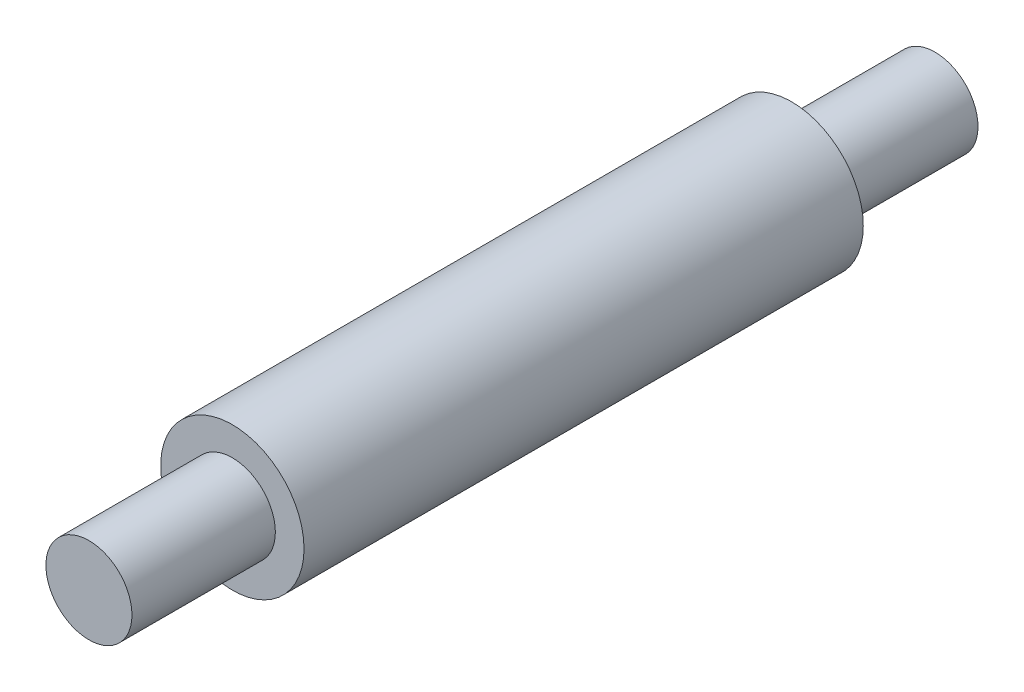
ISO-10303-21;
HEADER;
FILE_DESCRIPTION(('STEP AP214'),'2;1');
FILE_NAME('part.step','',(''),(''),'','','');
FILE_SCHEMA(('AUTOMOTIVE_DESIGN { 1 0 10303 214 1 1 1 1 }'));
ENDSEC;
DATA;
#1=APPLICATION_CONTEXT('core data for automotive mechanical design processes');
#2=APPLICATION_PROTOCOL_DEFINITION('international standard','automotive_design',2000,#1);
#3=PRODUCT_CONTEXT('',#1,'mechanical');
#4=PRODUCT('Part','Part','',(#3));
#5=PRODUCT_RELATED_PRODUCT_CATEGORY('part','',(#4));
#6=PRODUCT_DEFINITION_FORMATION('','',#4);
#7=PRODUCT_DEFINITION_CONTEXT('part definition',#1,'design');
#8=PRODUCT_DEFINITION('design','',#6,#7);
#9=PRODUCT_DEFINITION_SHAPE('','',#8);
#10=(LENGTH_UNIT() NAMED_UNIT(*) SI_UNIT(.MILLI.,.METRE.));
#11=(NAMED_UNIT(*) PLANE_ANGLE_UNIT() SI_UNIT($,.RADIAN.));
#12=(NAMED_UNIT(*) SI_UNIT($,.STERADIAN.) SOLID_ANGLE_UNIT());
#13=UNCERTAINTY_MEASURE_WITH_UNIT(LENGTH_MEASURE(1.E-05),#10,'distance_accuracy_value','');
#14=(GEOMETRIC_REPRESENTATION_CONTEXT(3) GLOBAL_UNCERTAINTY_ASSIGNED_CONTEXT((#13)) GLOBAL_UNIT_ASSIGNED_CONTEXT((#10,
#11,#12)) REPRESENTATION_CONTEXT('',''));
#15=CARTESIAN_POINT('',(0.,0.,0.));
#16=DIRECTION('',(0.,0.,1.));
#17=DIRECTION('',(1.,0.,0.));
#18=AXIS2_PLACEMENT_3D('',#15,#16,#17);
#19=CARTESIAN_POINT('',(0.,3.,0.));
#20=DIRECTION('',(0.,0.,-1.));
#21=DIRECTION('',(-1.,0.,0.));
#22=AXIS2_PLACEMENT_3D('',#19,#20,#21);
#23=PLANE('',#22);
#24=CARTESIAN_POINT('',(0.,0.,0.));
#25=DIRECTION('',(0.,0.,1.));
#26=DIRECTION('',(1.,0.,0.));
#27=AXIS2_PLACEMENT_3D('',#24,#25,#26);
#28=CIRCLE('',#27,3.);
#29=CARTESIAN_POINT('',(3.,0.,0.));
#30=VERTEX_POINT('',#29);
#31=EDGE_CURVE('E53',#30,#30,#28,.T.);
#32=ORIENTED_EDGE('',*,*,#31,.T.);
#33=EDGE_LOOP('',(#32));
#34=FACE_BOUND('',#33,.T.);
#35=ADVANCED_FACE('F31',(#34),#23,.F.);
#36=CARTESIAN_POINT('',(0.,0.,-59.));
#37=DIRECTION('',(0.,0.,1.));
#38=DIRECTION('',(1.,0.,0.));
#39=AXIS2_PLACEMENT_3D('',#36,#37,#38);
#40=PLANE('',#39);
#41=CARTESIAN_POINT('',(0.,0.,-59.));
#42=DIRECTION('',(0.,0.,1.));
#43=DIRECTION('',(1.,0.,0.));
#44=AXIS2_PLACEMENT_3D('',#41,#42,#43);
#45=CIRCLE('',#44,3.00000000000001);
#46=CARTESIAN_POINT('',(3.00000000000001,0.,-59.));
#47=VERTEX_POINT('',#46);
#48=EDGE_CURVE('E10',#47,#47,#45,.T.);
#49=ORIENTED_EDGE('',*,*,#48,.F.);
#50=EDGE_LOOP('',(#49));
#51=FACE_BOUND('',#50,.T.);
#52=ADVANCED_FACE('F83',(#51),#40,.F.);
#53=CARTESIAN_POINT('',(0.,0.,0.));
#54=DIRECTION('',(0.,0.,1.));
#55=DIRECTION('',(1.,0.,0.));
#56=AXIS2_PLACEMENT_3D('',#53,#54,#55);
#57=CYLINDRICAL_SURFACE('',#56,3.00000000000001);
#58=CARTESIAN_POINT('',(0.,0.,-49.));
#59=DIRECTION('',(0.,0.,1.));
#60=DIRECTION('',(1.,0.,0.));
#61=AXIS2_PLACEMENT_3D('',#58,#59,#60);
#62=CIRCLE('',#61,3.);
#63=CARTESIAN_POINT('',(3.,0.,-49.));
#64=VERTEX_POINT('',#63);
#65=EDGE_CURVE('E37',#64,#64,#62,.T.);
#66=ORIENTED_EDGE('',*,*,#65,.F.);
#67=EDGE_LOOP('',(#66));
#68=FACE_BOUND('',#67,.T.);
#69=ORIENTED_EDGE('',*,*,#48,.T.);
#70=EDGE_LOOP('',(#69));
#71=FACE_BOUND('',#70,.T.);
#72=ADVANCED_FACE('F78',(#68,#71),#57,.T.);
#73=CARTESIAN_POINT('',(0.,3.,-49.));
#74=DIRECTION('',(0.,0.,1.));
#75=DIRECTION('',(1.,0.,0.));
#76=AXIS2_PLACEMENT_3D('',#73,#74,#75);
#77=PLANE('',#76);
#78=CARTESIAN_POINT('',(0.,0.,-49.));
#79=DIRECTION('',(0.,0.,1.));
#80=DIRECTION('',(1.,0.,0.));
#81=AXIS2_PLACEMENT_3D('',#78,#79,#80);
#82=CIRCLE('',#81,5.);
#83=CARTESIAN_POINT('',(5.,0.,-49.));
#84=VERTEX_POINT('',#83);
#85=EDGE_CURVE('E41',#84,#84,#82,.T.);
#86=ORIENTED_EDGE('',*,*,#85,.F.);
#87=EDGE_LOOP('',(#86));
#88=FACE_BOUND('',#87,.T.);
#89=ORIENTED_EDGE('',*,*,#65,.T.);
#90=EDGE_LOOP('',(#89));
#91=FACE_BOUND('',#90,.T.);
#92=ADVANCED_FACE('F73',(#88,#91),#77,.F.);
#93=CARTESIAN_POINT('',(0.,0.,0.));
#94=DIRECTION('',(0.,0.,1.));
#95=DIRECTION('',(1.,0.,0.));
#96=AXIS2_PLACEMENT_3D('',#93,#94,#95);
#97=CYLINDRICAL_SURFACE('',#96,5.);
#98=CARTESIAN_POINT('',(0.,0.,-10.));
#99=DIRECTION('',(0.,0.,1.));
#100=DIRECTION('',(1.,0.,0.));
#101=AXIS2_PLACEMENT_3D('',#98,#99,#100);
#102=CIRCLE('',#101,4.99999999999999);
#103=CARTESIAN_POINT('',(4.99999999999999,0.,-10.));
#104=VERTEX_POINT('',#103);
#105=EDGE_CURVE('E45',#104,#104,#102,.T.);
#106=ORIENTED_EDGE('',*,*,#105,.F.);
#107=EDGE_LOOP('',(#106));
#108=FACE_BOUND('',#107,.T.);
#109=ORIENTED_EDGE('',*,*,#85,.T.);
#110=EDGE_LOOP('',(#109));
#111=FACE_BOUND('',#110,.T.);
#112=ADVANCED_FACE('F67',(#108,#111),#97,.T.);
#113=CARTESIAN_POINT('',(0.,4.99999999999999,-10.));
#114=DIRECTION('',(0.,0.,-1.));
#115=DIRECTION('',(-1.,0.,0.));
#116=AXIS2_PLACEMENT_3D('',#113,#114,#115);
#117=PLANE('',#116);
#118=CARTESIAN_POINT('',(0.,0.,-10.));
#119=DIRECTION('',(0.,0.,1.));
#120=DIRECTION('',(1.,0.,0.));
#121=AXIS2_PLACEMENT_3D('',#118,#119,#120);
#122=CIRCLE('',#121,3.);
#123=CARTESIAN_POINT('',(3.,0.,-10.));
#124=VERTEX_POINT('',#123);
#125=EDGE_CURVE('E50',#124,#124,#122,.T.);
#126=ORIENTED_EDGE('',*,*,#125,.F.);
#127=EDGE_LOOP('',(#126));
#128=FACE_BOUND('',#127,.T.);
#129=ORIENTED_EDGE('',*,*,#105,.T.);
#130=EDGE_LOOP('',(#129));
#131=FACE_BOUND('',#130,.T.);
#132=ADVANCED_FACE('F61',(#128,#131),#117,.F.);
#133=CARTESIAN_POINT('',(0.,0.,0.));
#134=DIRECTION('',(0.,0.,1.));
#135=DIRECTION('',(1.,0.,0.));
#136=AXIS2_PLACEMENT_3D('',#133,#134,#135);
#137=CYLINDRICAL_SURFACE('',#136,3.);
#138=ORIENTED_EDGE('',*,*,#31,.F.);
#139=EDGE_LOOP('',(#138));
#140=FACE_BOUND('',#139,.T.);
#141=ORIENTED_EDGE('',*,*,#125,.T.);
#142=EDGE_LOOP('',(#141));
#143=FACE_BOUND('',#142,.T.);
#144=ADVANCED_FACE('F58',(#140,#143),#137,.T.);
#145=CLOSED_SHELL('',(#35,#52,#72,#92,#112,#132,#144));
#146=MANIFOLD_SOLID_BREP('B2',#145);
#147=ADVANCED_BREP_SHAPE_REPRESENTATION('',(#18,#146),#14);
#148=SHAPE_DEFINITION_REPRESENTATION(#9,#147);
ENDSEC;
END-ISO-10303-21;
